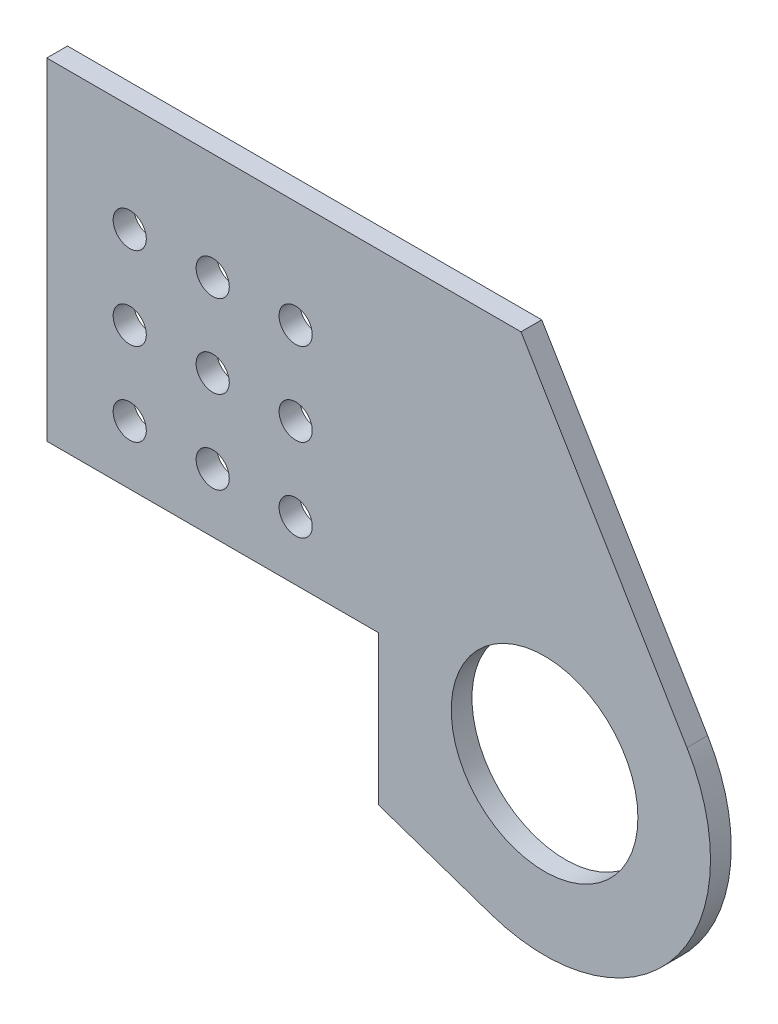
ISO-10303-21;
HEADER;
FILE_DESCRIPTION(('STEP AP214'),'2;1');
FILE_NAME('part.step','',(''),(''),'','','');
FILE_SCHEMA(('AUTOMOTIVE_DESIGN { 1 0 10303 214 1 1 1 1 }'));
ENDSEC;
DATA;
#1=APPLICATION_CONTEXT('core data for automotive mechanical design processes');
#2=APPLICATION_PROTOCOL_DEFINITION('international standard','automotive_design',2000,#1);
#3=PRODUCT_CONTEXT('',#1,'mechanical');
#4=PRODUCT('Part','Part','',(#3));
#5=PRODUCT_RELATED_PRODUCT_CATEGORY('part','',(#4));
#6=PRODUCT_DEFINITION_FORMATION('','',#4);
#7=PRODUCT_DEFINITION_CONTEXT('part definition',#1,'design');
#8=PRODUCT_DEFINITION('design','',#6,#7);
#9=PRODUCT_DEFINITION_SHAPE('','',#8);
#10=(LENGTH_UNIT() NAMED_UNIT(*) SI_UNIT(.MILLI.,.METRE.));
#11=(NAMED_UNIT(*) PLANE_ANGLE_UNIT() SI_UNIT($,.RADIAN.));
#12=(NAMED_UNIT(*) SI_UNIT($,.STERADIAN.) SOLID_ANGLE_UNIT());
#13=UNCERTAINTY_MEASURE_WITH_UNIT(LENGTH_MEASURE(1.E-05),#10,'distance_accuracy_value','');
#14=(GEOMETRIC_REPRESENTATION_CONTEXT(3) GLOBAL_UNCERTAINTY_ASSIGNED_CONTEXT((#13)) GLOBAL_UNIT_ASSIGNED_CONTEXT((#10,
#11,#12)) REPRESENTATION_CONTEXT('',''));
#15=CARTESIAN_POINT('',(0.,0.,0.));
#16=DIRECTION('',(0.,0.,1.));
#17=DIRECTION('',(1.,0.,0.));
#18=AXIS2_PLACEMENT_3D('',#15,#16,#17);
#19=CARTESIAN_POINT('',(76.2,-4.6676676490266,3.175));
#20=DIRECTION('',(0.,0.,-1.));
#21=DIRECTION('',(-1.,0.,0.));
#22=AXIS2_PLACEMENT_3D('',#19,#20,#21);
#23=CYLINDRICAL_SURFACE('',#22,25.4);
#24=CARTESIAN_POINT('',(76.2,-4.6676676490266,0.));
#25=DIRECTION('',(0.,0.,1.));
#26=DIRECTION('',(1.,0.,0.));
#27=AXIS2_PLACEMENT_3D('',#24,#25,#26);
#28=CIRCLE('',#27,25.4);
#29=CARTESIAN_POINT('',(97.9919431570772,8.38113357709056,0.));
#30=VERTEX_POINT('',#29);
#31=CARTESIAN_POINT('',(67.9854944904152,-28.7026816750887,0.));
#32=VERTEX_POINT('',#31);
#33=EDGE_CURVE('E147',#30,#32,#28,.F.);
#34=ORIENTED_EDGE('',*,*,#33,.F.);
#35=DIRECTION('',(0.,0.,-1.));
#36=VECTOR('',#35,1.);
#37=CARTESIAN_POINT('',(97.9919431570772,8.38113357709056,3.175));
#38=LINE('',#37,#36);
#39=CARTESIAN_POINT('',(97.9919431570772,8.38113357709056,3.175));
#40=VERTEX_POINT('',#39);
#41=EDGE_CURVE('E11',#40,#30,#38,.T.);
#42=ORIENTED_EDGE('',*,*,#41,.F.);
#43=CARTESIAN_POINT('',(76.2,-4.6676676490266,3.175));
#44=DIRECTION('',(0.,0.,1.));
#45=DIRECTION('',(1.,0.,0.));
#46=AXIS2_PLACEMENT_3D('',#43,#44,#45);
#47=CIRCLE('',#46,25.4);
#48=CARTESIAN_POINT('',(67.9854944904152,-28.7026816750887,3.175));
#49=VERTEX_POINT('',#48);
#50=EDGE_CURVE('E401',#40,#49,#47,.F.);
#51=ORIENTED_EDGE('',*,*,#50,.T.);
#52=DIRECTION('',(0.,0.,-1.));
#53=VECTOR('',#52,1.);
#54=CARTESIAN_POINT('',(67.9854944904152,-28.7026816750887,3.175));
#55=LINE('',#54,#53);
#56=EDGE_CURVE('E58',#49,#32,#55,.T.);
#57=ORIENTED_EDGE('',*,*,#56,.T.);
#58=EDGE_LOOP('',(#34,#42,#51,#57));
#59=FACE_BOUND('',#58,.T.);
#60=ADVANCED_FACE('F41',(#59),#23,.T.);
#61=CARTESIAN_POINT('',(75.823863099134,45.4025834522974,3.175));
#62=DIRECTION('',(0.857950517995165,0.513732331736896,0.));
#63=DIRECTION('',(-0.513732331736896,0.857950517995165,0.));
#64=AXIS2_PLACEMENT_3D('',#61,#62,#63);
#65=PLANE('',#64);
#66=DIRECTION('',(0.513732331736896,-0.857950517995165,0.));
#67=VECTOR('',#66,1.);
#68=CARTESIAN_POINT('',(75.823863099134,45.4025834522974,0.));
#69=LINE('',#68,#67);
#70=CARTESIAN_POINT('',(72.5919431570772,50.8,0.));
#71=VERTEX_POINT('',#70);
#72=EDGE_CURVE('E144',#71,#30,#69,.T.);
#73=ORIENTED_EDGE('',*,*,#72,.F.);
#74=DIRECTION('',(0.,0.,-1.));
#75=VECTOR('',#74,1.);
#76=CARTESIAN_POINT('',(72.5919431570772,50.8,3.175));
#77=LINE('',#76,#75);
#78=CARTESIAN_POINT('',(72.5919431570772,50.8,3.175));
#79=VERTEX_POINT('',#78);
#80=EDGE_CURVE('E50',#79,#71,#77,.T.);
#81=ORIENTED_EDGE('',*,*,#80,.F.);
#82=DIRECTION('',(0.513732331736896,-0.857950517995165,0.));
#83=VECTOR('',#82,1.);
#84=CARTESIAN_POINT('',(75.823863099134,45.4025834522974,3.175));
#85=LINE('',#84,#83);
#86=EDGE_CURVE('E398',#79,#40,#85,.T.);
#87=ORIENTED_EDGE('',*,*,#86,.T.);
#88=ORIENTED_EDGE('',*,*,#41,.T.);
#89=EDGE_LOOP('',(#73,#81,#87,#88));
#90=FACE_BOUND('',#89,.T.);
#91=ADVANCED_FACE('F145',(#90),#65,.T.);
#92=CARTESIAN_POINT('',(0.,50.8,3.175));
#93=DIRECTION('',(0.,1.,0.));
#94=DIRECTION('',(0.,0.,1.));
#95=AXIS2_PLACEMENT_3D('',#92,#93,#94);
#96=PLANE('',#95);
#97=DIRECTION('',(1.,0.,0.));
#98=VECTOR('',#97,1.);
#99=CARTESIAN_POINT('',(0.,50.8,0.));
#100=LINE('',#99,#98);
#101=CARTESIAN_POINT('',(0.,50.8,0.));
#102=VERTEX_POINT('',#101);
#103=EDGE_CURVE('E137',#102,#71,#100,.T.);
#104=ORIENTED_EDGE('',*,*,#103,.F.);
#105=DIRECTION('',(0.,0.,-1.));
#106=VECTOR('',#105,1.);
#107=CARTESIAN_POINT('',(0.,50.8,3.175));
#108=LINE('',#107,#106);
#109=CARTESIAN_POINT('',(0.,50.8,3.175));
#110=VERTEX_POINT('',#109);
#111=EDGE_CURVE('E126',#110,#102,#108,.T.);
#112=ORIENTED_EDGE('',*,*,#111,.F.);
#113=DIRECTION('',(1.,0.,0.));
#114=VECTOR('',#113,1.);
#115=CARTESIAN_POINT('',(0.,50.8,3.175));
#116=LINE('',#115,#114);
#117=EDGE_CURVE('E139',#110,#79,#116,.T.);
#118=ORIENTED_EDGE('',*,*,#117,.T.);
#119=ORIENTED_EDGE('',*,*,#80,.T.);
#120=EDGE_LOOP('',(#104,#112,#118,#119));
#121=FACE_BOUND('',#120,.T.);
#122=ADVANCED_FACE('F135',(#121),#96,.T.);
#123=CARTESIAN_POINT('',(0.,0.,3.175));
#124=DIRECTION('',(-1.,0.,0.));
#125=DIRECTION('',(0.,0.,1.));
#126=AXIS2_PLACEMENT_3D('',#123,#124,#125);
#127=PLANE('',#126);
#128=DIRECTION('',(0.,1.,0.));
#129=VECTOR('',#128,1.);
#130=CARTESIAN_POINT('',(0.,0.,0.));
#131=LINE('',#130,#129);
#132=CARTESIAN_POINT('',(0.,0.,0.));
#133=VERTEX_POINT('',#132);
#134=EDGE_CURVE('E151',#133,#102,#131,.T.);
#135=ORIENTED_EDGE('',*,*,#134,.F.);
#136=DIRECTION('',(0.,0.,-1.));
#137=VECTOR('',#136,1.);
#138=CARTESIAN_POINT('',(0.,0.,3.175));
#139=LINE('',#138,#137);
#140=CARTESIAN_POINT('',(0.,0.,3.175));
#141=VERTEX_POINT('',#140);
#142=EDGE_CURVE('E124',#141,#133,#139,.T.);
#143=ORIENTED_EDGE('',*,*,#142,.F.);
#144=DIRECTION('',(0.,1.,0.));
#145=VECTOR('',#144,1.);
#146=CARTESIAN_POINT('',(0.,0.,3.175));
#147=LINE('',#146,#145);
#148=EDGE_CURVE('E118',#141,#110,#147,.T.);
#149=ORIENTED_EDGE('',*,*,#148,.T.);
#150=ORIENTED_EDGE('',*,*,#111,.T.);
#151=EDGE_LOOP('',(#135,#143,#149,#150));
#152=FACE_BOUND('',#151,.T.);
#153=ADVANCED_FACE('F369',(#152),#127,.T.);
#154=CARTESIAN_POINT('',(0.,0.,3.175));
#155=DIRECTION('',(0.,1.,0.));
#156=DIRECTION('',(0.,0.,1.));
#157=AXIS2_PLACEMENT_3D('',#154,#155,#156);
#158=PLANE('',#157);
#159=DIRECTION('',(1.,0.,0.));
#160=VECTOR('',#159,1.);
#161=CARTESIAN_POINT('',(0.,0.,0.));
#162=LINE('',#161,#160);
#163=CARTESIAN_POINT('',(50.8,0.,0.));
#164=VERTEX_POINT('',#163);
#165=EDGE_CURVE('E123',#133,#164,#162,.T.);
#166=ORIENTED_EDGE('',*,*,#165,.T.);
#167=DIRECTION('',(0.,0.,-1.));
#168=VECTOR('',#167,1.);
#169=CARTESIAN_POINT('',(50.8,0.,3.175));
#170=LINE('',#169,#168);
#171=CARTESIAN_POINT('',(50.8,0.,3.175));
#172=VERTEX_POINT('',#171);
#173=EDGE_CURVE('E106',#172,#164,#170,.T.);
#174=ORIENTED_EDGE('',*,*,#173,.F.);
#175=DIRECTION('',(1.,0.,0.));
#176=VECTOR('',#175,1.);
#177=CARTESIAN_POINT('',(0.,0.,3.175));
#178=LINE('',#177,#176);
#179=EDGE_CURVE('E111',#141,#172,#178,.T.);
#180=ORIENTED_EDGE('',*,*,#179,.F.);
#181=ORIENTED_EDGE('',*,*,#142,.T.);
#182=EDGE_LOOP('',(#166,#174,#180,#181));
#183=FACE_BOUND('',#182,.T.);
#184=ADVANCED_FACE('F121',(#183),#158,.F.);
#185=CARTESIAN_POINT('',(50.8,0.,3.175));
#186=DIRECTION('',(1.,0.,0.));
#187=DIRECTION('',(0.,1.,0.));
#188=AXIS2_PLACEMENT_3D('',#185,#186,#187);
#189=PLANE('',#188);
#190=DIRECTION('',(0.,-1.,0.));
#191=VECTOR('',#190,1.);
#192=CARTESIAN_POINT('',(50.8,0.,0.));
#193=LINE('',#192,#191);
#194=CARTESIAN_POINT('',(50.8,-22.8291532043593,0.));
#195=VERTEX_POINT('',#194);
#196=EDGE_CURVE('E157',#164,#195,#193,.T.);
#197=ORIENTED_EDGE('',*,*,#196,.T.);
#198=DIRECTION('',(0.,0.,-1.));
#199=VECTOR('',#198,1.);
#200=CARTESIAN_POINT('',(50.8,-22.8291532043593,3.175));
#201=LINE('',#200,#199);
#202=CARTESIAN_POINT('',(50.8,-22.8291532043593,3.175));
#203=VERTEX_POINT('',#202);
#204=EDGE_CURVE('E81',#203,#195,#201,.T.);
#205=ORIENTED_EDGE('',*,*,#204,.F.);
#206=DIRECTION('',(0.,-1.,0.));
#207=VECTOR('',#206,1.);
#208=CARTESIAN_POINT('',(50.8,0.,3.175));
#209=LINE('',#208,#207);
#210=EDGE_CURVE('E102',#172,#203,#209,.T.);
#211=ORIENTED_EDGE('',*,*,#210,.F.);
#212=ORIENTED_EDGE('',*,*,#173,.T.);
#213=EDGE_LOOP('',(#197,#205,#211,#212));
#214=FACE_BOUND('',#213,.T.);
#215=ADVANCED_FACE('F104',(#214),#189,.F.);
#216=CARTESIAN_POINT('',(12.7,34.4279406596627,3.175));
#217=DIRECTION('',(0.,0.,-1.));
#218=DIRECTION('',(-1.,0.,0.));
#219=AXIS2_PLACEMENT_3D('',#216,#217,#218);
#220=CYLINDRICAL_SURFACE('',#219,2.54);
#221=CARTESIAN_POINT('',(12.7,34.4279406596627,3.175));
#222=DIRECTION('',(0.,0.,1.));
#223=DIRECTION('',(1.,0.,0.));
#224=AXIS2_PLACEMENT_3D('',#221,#222,#223);
#225=CIRCLE('',#224,2.54);
#226=CARTESIAN_POINT('',(15.24,34.4279406596627,3.175));
#227=VERTEX_POINT('',#226);
#228=EDGE_CURVE('E405',#227,#227,#225,.T.);
#229=ORIENTED_EDGE('',*,*,#228,.T.);
#230=EDGE_LOOP('',(#229));
#231=FACE_BOUND('',#230,.T.);
#232=CARTESIAN_POINT('',(12.7,34.4279406596627,0.));
#233=DIRECTION('',(0.,0.,1.));
#234=DIRECTION('',(1.,0.,0.));
#235=AXIS2_PLACEMENT_3D('',#232,#233,#234);
#236=CIRCLE('',#235,2.54);
#237=CARTESIAN_POINT('',(15.24,34.4279406596627,0.));
#238=VERTEX_POINT('',#237);
#239=EDGE_CURVE('E191',#238,#238,#236,.T.);
#240=ORIENTED_EDGE('',*,*,#239,.F.);
#241=EDGE_LOOP('',(#240));
#242=FACE_BOUND('',#241,.T.);
#243=ADVANCED_FACE('F214',(#231,#242),#220,.F.);
#244=CARTESIAN_POINT('',(25.4,34.4279406596627,3.175));
#245=DIRECTION('',(0.,0.,-1.));
#246=DIRECTION('',(-1.,0.,0.));
#247=AXIS2_PLACEMENT_3D('',#244,#245,#246);
#248=CYLINDRICAL_SURFACE('',#247,2.54);
#249=CARTESIAN_POINT('',(25.4,34.4279406596627,3.175));
#250=DIRECTION('',(0.,0.,1.));
#251=DIRECTION('',(1.,0.,0.));
#252=AXIS2_PLACEMENT_3D('',#249,#250,#251);
#253=CIRCLE('',#252,2.54);
#254=CARTESIAN_POINT('',(27.94,34.4279406596627,3.175));
#255=VERTEX_POINT('',#254);
#256=EDGE_CURVE('E408',#255,#255,#253,.T.);
#257=ORIENTED_EDGE('',*,*,#256,.T.);
#258=EDGE_LOOP('',(#257));
#259=FACE_BOUND('',#258,.T.);
#260=CARTESIAN_POINT('',(25.4,34.4279406596627,0.));
#261=DIRECTION('',(0.,0.,1.));
#262=DIRECTION('',(1.,0.,0.));
#263=AXIS2_PLACEMENT_3D('',#260,#261,#262);
#264=CIRCLE('',#263,2.54);
#265=CARTESIAN_POINT('',(27.94,34.4279406596627,0.));
#266=VERTEX_POINT('',#265);
#267=EDGE_CURVE('E188',#266,#266,#264,.T.);
#268=ORIENTED_EDGE('',*,*,#267,.F.);
#269=EDGE_LOOP('',(#268));
#270=FACE_BOUND('',#269,.T.);
#271=ADVANCED_FACE('F217',(#259,#270),#248,.F.);
#272=CARTESIAN_POINT('',(38.1,34.4279406596627,3.175));
#273=DIRECTION('',(0.,0.,-1.));
#274=DIRECTION('',(-1.,0.,0.));
#275=AXIS2_PLACEMENT_3D('',#272,#273,#274);
#276=CYLINDRICAL_SURFACE('',#275,2.54);
#277=CARTESIAN_POINT('',(38.1,34.4279406596627,3.175));
#278=DIRECTION('',(0.,0.,1.));
#279=DIRECTION('',(1.,0.,0.));
#280=AXIS2_PLACEMENT_3D('',#277,#278,#279);
#281=CIRCLE('',#280,2.54);
#282=CARTESIAN_POINT('',(40.64,34.4279406596627,3.175));
#283=VERTEX_POINT('',#282);
#284=EDGE_CURVE('E411',#283,#283,#281,.T.);
#285=ORIENTED_EDGE('',*,*,#284,.T.);
#286=EDGE_LOOP('',(#285));
#287=FACE_BOUND('',#286,.T.);
#288=CARTESIAN_POINT('',(38.1,34.4279406596627,0.));
#289=DIRECTION('',(0.,0.,1.));
#290=DIRECTION('',(1.,0.,0.));
#291=AXIS2_PLACEMENT_3D('',#288,#289,#290);
#292=CIRCLE('',#291,2.54);
#293=CARTESIAN_POINT('',(40.64,34.4279406596627,0.));
#294=VERTEX_POINT('',#293);
#295=EDGE_CURVE('E185',#294,#294,#292,.T.);
#296=ORIENTED_EDGE('',*,*,#295,.F.);
#297=EDGE_LOOP('',(#296));
#298=FACE_BOUND('',#297,.T.);
#299=ADVANCED_FACE('F221',(#287,#298),#276,.F.);
#300=CARTESIAN_POINT('',(25.4,21.7279406596627,3.175));
#301=DIRECTION('',(0.,0.,-1.));
#302=DIRECTION('',(-1.,0.,0.));
#303=AXIS2_PLACEMENT_3D('',#300,#301,#302);
#304=CYLINDRICAL_SURFACE('',#303,2.54);
#305=CARTESIAN_POINT('',(25.4,21.7279406596627,3.175));
#306=DIRECTION('',(0.,0.,1.));
#307=DIRECTION('',(1.,0.,0.));
#308=AXIS2_PLACEMENT_3D('',#305,#306,#307);
#309=CIRCLE('',#308,2.54);
#310=CARTESIAN_POINT('',(27.94,21.7279406596627,3.175));
#311=VERTEX_POINT('',#310);
#312=EDGE_CURVE('E414',#311,#311,#309,.T.);
#313=ORIENTED_EDGE('',*,*,#312,.T.);
#314=EDGE_LOOP('',(#313));
#315=FACE_BOUND('',#314,.T.);
#316=CARTESIAN_POINT('',(25.4,21.7279406596627,0.));
#317=DIRECTION('',(0.,0.,1.));
#318=DIRECTION('',(1.,0.,0.));
#319=AXIS2_PLACEMENT_3D('',#316,#317,#318);
#320=CIRCLE('',#319,2.54);
#321=CARTESIAN_POINT('',(27.94,21.7279406596627,0.));
#322=VERTEX_POINT('',#321);
#323=EDGE_CURVE('E182',#322,#322,#320,.T.);
#324=ORIENTED_EDGE('',*,*,#323,.F.);
#325=EDGE_LOOP('',(#324));
#326=FACE_BOUND('',#325,.T.);
#327=ADVANCED_FACE('F225',(#315,#326),#304,.F.);
#328=CARTESIAN_POINT('',(38.1,21.7279406596627,3.175));
#329=DIRECTION('',(0.,0.,-1.));
#330=DIRECTION('',(-1.,0.,0.));
#331=AXIS2_PLACEMENT_3D('',#328,#329,#330);
#332=CYLINDRICAL_SURFACE('',#331,2.54);
#333=CARTESIAN_POINT('',(38.1,21.7279406596627,3.175));
#334=DIRECTION('',(0.,0.,1.));
#335=DIRECTION('',(1.,0.,0.));
#336=AXIS2_PLACEMENT_3D('',#333,#334,#335);
#337=CIRCLE('',#336,2.54);
#338=CARTESIAN_POINT('',(40.64,21.7279406596627,3.175));
#339=VERTEX_POINT('',#338);
#340=EDGE_CURVE('E417',#339,#339,#337,.T.);
#341=ORIENTED_EDGE('',*,*,#340,.T.);
#342=EDGE_LOOP('',(#341));
#343=FACE_BOUND('',#342,.T.);
#344=CARTESIAN_POINT('',(38.1,21.7279406596627,0.));
#345=DIRECTION('',(0.,0.,1.));
#346=DIRECTION('',(1.,0.,0.));
#347=AXIS2_PLACEMENT_3D('',#344,#345,#346);
#348=CIRCLE('',#347,2.54);
#349=CARTESIAN_POINT('',(40.64,21.7279406596627,0.));
#350=VERTEX_POINT('',#349);
#351=EDGE_CURVE('E179',#350,#350,#348,.T.);
#352=ORIENTED_EDGE('',*,*,#351,.F.);
#353=EDGE_LOOP('',(#352));
#354=FACE_BOUND('',#353,.T.);
#355=ADVANCED_FACE('F229',(#343,#354),#332,.F.);
#356=CARTESIAN_POINT('',(25.4,9.02794065966268,3.175));
#357=DIRECTION('',(0.,0.,-1.));
#358=DIRECTION('',(-1.,0.,0.));
#359=AXIS2_PLACEMENT_3D('',#356,#357,#358);
#360=CYLINDRICAL_SURFACE('',#359,2.54);
#361=CARTESIAN_POINT('',(25.4,9.02794065966268,3.175));
#362=DIRECTION('',(0.,0.,1.));
#363=DIRECTION('',(1.,0.,0.));
#364=AXIS2_PLACEMENT_3D('',#361,#362,#363);
#365=CIRCLE('',#364,2.54);
#366=CARTESIAN_POINT('',(27.94,9.02794065966268,3.175));
#367=VERTEX_POINT('',#366);
#368=EDGE_CURVE('E420',#367,#367,#365,.T.);
#369=ORIENTED_EDGE('',*,*,#368,.T.);
#370=EDGE_LOOP('',(#369));
#371=FACE_BOUND('',#370,.T.);
#372=CARTESIAN_POINT('',(25.4,9.02794065966268,0.));
#373=DIRECTION('',(0.,0.,1.));
#374=DIRECTION('',(1.,0.,0.));
#375=AXIS2_PLACEMENT_3D('',#372,#373,#374);
#376=CIRCLE('',#375,2.54);
#377=CARTESIAN_POINT('',(27.94,9.02794065966268,0.));
#378=VERTEX_POINT('',#377);
#379=EDGE_CURVE('E176',#378,#378,#376,.T.);
#380=ORIENTED_EDGE('',*,*,#379,.F.);
#381=EDGE_LOOP('',(#380));
#382=FACE_BOUND('',#381,.T.);
#383=ADVANCED_FACE('F233',(#371,#382),#360,.F.);
#384=CARTESIAN_POINT('',(38.1,9.02794065966268,3.175));
#385=DIRECTION('',(0.,0.,-1.));
#386=DIRECTION('',(-1.,0.,0.));
#387=AXIS2_PLACEMENT_3D('',#384,#385,#386);
#388=CYLINDRICAL_SURFACE('',#387,2.54);
#389=CARTESIAN_POINT('',(38.1,9.02794065966268,3.175));
#390=DIRECTION('',(0.,0.,1.));
#391=DIRECTION('',(1.,0.,0.));
#392=AXIS2_PLACEMENT_3D('',#389,#390,#391);
#393=CIRCLE('',#392,2.54);
#394=CARTESIAN_POINT('',(40.64,9.02794065966268,3.175));
#395=VERTEX_POINT('',#394);
#396=EDGE_CURVE('E423',#395,#395,#393,.T.);
#397=ORIENTED_EDGE('',*,*,#396,.T.);
#398=EDGE_LOOP('',(#397));
#399=FACE_BOUND('',#398,.T.);
#400=CARTESIAN_POINT('',(38.1,9.02794065966268,0.));
#401=DIRECTION('',(0.,0.,1.));
#402=DIRECTION('',(1.,0.,0.));
#403=AXIS2_PLACEMENT_3D('',#400,#401,#402);
#404=CIRCLE('',#403,2.54);
#405=CARTESIAN_POINT('',(40.64,9.02794065966268,0.));
#406=VERTEX_POINT('',#405);
#407=EDGE_CURVE('E173',#406,#406,#404,.T.);
#408=ORIENTED_EDGE('',*,*,#407,.F.);
#409=EDGE_LOOP('',(#408));
#410=FACE_BOUND('',#409,.T.);
#411=ADVANCED_FACE('F237',(#399,#410),#388,.F.);
#412=CARTESIAN_POINT('',(12.7,21.7279406596627,3.175));
#413=DIRECTION('',(0.,0.,-1.));
#414=DIRECTION('',(-1.,0.,0.));
#415=AXIS2_PLACEMENT_3D('',#412,#413,#414);
#416=CYLINDRICAL_SURFACE('',#415,2.54);
#417=CARTESIAN_POINT('',(12.7,21.7279406596627,3.175));
#418=DIRECTION('',(0.,0.,1.));
#419=DIRECTION('',(1.,0.,0.));
#420=AXIS2_PLACEMENT_3D('',#417,#418,#419);
#421=CIRCLE('',#420,2.54);
#422=CARTESIAN_POINT('',(15.24,21.7279406596627,3.175));
#423=VERTEX_POINT('',#422);
#424=EDGE_CURVE('E426',#423,#423,#421,.T.);
#425=ORIENTED_EDGE('',*,*,#424,.T.);
#426=EDGE_LOOP('',(#425));
#427=FACE_BOUND('',#426,.T.);
#428=CARTESIAN_POINT('',(12.7,21.7279406596627,0.));
#429=DIRECTION('',(0.,0.,1.));
#430=DIRECTION('',(1.,0.,0.));
#431=AXIS2_PLACEMENT_3D('',#428,#429,#430);
#432=CIRCLE('',#431,2.54);
#433=CARTESIAN_POINT('',(15.24,21.7279406596627,0.));
#434=VERTEX_POINT('',#433);
#435=EDGE_CURVE('E170',#434,#434,#432,.T.);
#436=ORIENTED_EDGE('',*,*,#435,.F.);
#437=EDGE_LOOP('',(#436));
#438=FACE_BOUND('',#437,.T.);
#439=ADVANCED_FACE('F241',(#427,#438),#416,.F.);
#440=CARTESIAN_POINT('',(12.7,9.02794065966268,3.175));
#441=DIRECTION('',(0.,0.,-1.));
#442=DIRECTION('',(-1.,0.,0.));
#443=AXIS2_PLACEMENT_3D('',#440,#441,#442);
#444=CYLINDRICAL_SURFACE('',#443,2.54);
#445=CARTESIAN_POINT('',(12.7,9.02794065966268,3.175));
#446=DIRECTION('',(0.,0.,1.));
#447=DIRECTION('',(1.,0.,0.));
#448=AXIS2_PLACEMENT_3D('',#445,#446,#447);
#449=CIRCLE('',#448,2.54);
#450=CARTESIAN_POINT('',(15.24,9.02794065966268,3.175));
#451=VERTEX_POINT('',#450);
#452=EDGE_CURVE('E252',#451,#451,#449,.T.);
#453=ORIENTED_EDGE('',*,*,#452,.T.);
#454=EDGE_LOOP('',(#453));
#455=FACE_BOUND('',#454,.T.);
#456=CARTESIAN_POINT('',(12.7,9.02794065966268,0.));
#457=DIRECTION('',(0.,0.,1.));
#458=DIRECTION('',(1.,0.,0.));
#459=AXIS2_PLACEMENT_3D('',#456,#457,#458);
#460=CIRCLE('',#459,2.54);
#461=CARTESIAN_POINT('',(15.24,9.02794065966268,0.));
#462=VERTEX_POINT('',#461);
#463=EDGE_CURVE('E167',#462,#462,#460,.T.);
#464=ORIENTED_EDGE('',*,*,#463,.F.);
#465=EDGE_LOOP('',(#464));
#466=FACE_BOUND('',#465,.T.);
#467=ADVANCED_FACE('F202',(#455,#466),#444,.F.);
#468=CARTESIAN_POINT('',(76.2,-4.6676676490266,3.175));
#469=DIRECTION('',(0.,0.,-1.));
#470=DIRECTION('',(-1.,0.,0.));
#471=AXIS2_PLACEMENT_3D('',#468,#469,#470);
#472=CYLINDRICAL_SURFACE('',#471,14.287499999975);
#473=CARTESIAN_POINT('',(76.2,-4.6676676490266,3.175));
#474=DIRECTION('',(0.,0.,1.));
#475=DIRECTION('',(1.,0.,0.));
#476=AXIS2_PLACEMENT_3D('',#473,#474,#475);
#477=CIRCLE('',#476,14.287499999975);
#478=CARTESIAN_POINT('',(90.487499999975,-4.6676676490266,3.175));
#479=VERTEX_POINT('',#478);
#480=EDGE_CURVE('E161',#479,#479,#477,.T.);
#481=ORIENTED_EDGE('',*,*,#480,.T.);
#482=EDGE_LOOP('',(#481));
#483=FACE_BOUND('',#482,.T.);
#484=CARTESIAN_POINT('',(76.2,-4.6676676490266,0.));
#485=DIRECTION('',(0.,0.,1.));
#486=DIRECTION('',(1.,0.,0.));
#487=AXIS2_PLACEMENT_3D('',#484,#485,#486);
#488=CIRCLE('',#487,14.287499999975);
#489=CARTESIAN_POINT('',(90.487499999975,-4.6676676490266,0.));
#490=VERTEX_POINT('',#489);
#491=EDGE_CURVE('E164',#490,#490,#488,.T.);
#492=ORIENTED_EDGE('',*,*,#491,.F.);
#493=EDGE_LOOP('',(#492));
#494=FACE_BOUND('',#493,.T.);
#495=ADVANCED_FACE('F43',(#483,#494),#472,.F.);
#496=CARTESIAN_POINT('',(-1.67307890003513,-4.89530073138697,3.175));
#497=DIRECTION('',(-0.323405728723812,-0.946260394726853,0.));
#498=DIRECTION('',(0.946260394726853,-0.323405728723812,0.));
#499=AXIS2_PLACEMENT_3D('',#496,#497,#498);
#500=PLANE('',#499);
#501=DIRECTION('',(-0.946260394726853,0.323405728723812,0.));
#502=VECTOR('',#501,1.);
#503=CARTESIAN_POINT('',(-1.67307890003513,-4.89530073138697,0.));
#504=LINE('',#503,#502);
#505=EDGE_CURVE('E159',#32,#195,#504,.T.);
#506=ORIENTED_EDGE('',*,*,#505,.F.);
#507=ORIENTED_EDGE('',*,*,#56,.F.);
#508=DIRECTION('',(-0.946260394726853,0.323405728723812,0.));
#509=VECTOR('',#508,1.);
#510=CARTESIAN_POINT('',(-1.67307890003513,-4.89530073138697,3.175));
#511=LINE('',#510,#509);
#512=EDGE_CURVE('E110',#49,#203,#511,.T.);
#513=ORIENTED_EDGE('',*,*,#512,.T.);
#514=ORIENTED_EDGE('',*,*,#204,.T.);
#515=EDGE_LOOP('',(#506,#507,#513,#514));
#516=FACE_BOUND('',#515,.T.);
#517=ADVANCED_FACE('F193',(#516),#500,.T.);
#518=CARTESIAN_POINT('',(0.,0.,3.175));
#519=DIRECTION('',(0.,0.,1.));
#520=DIRECTION('',(1.,0.,0.));
#521=AXIS2_PLACEMENT_3D('',#518,#519,#520);
#522=PLANE('',#521);
#523=ORIENTED_EDGE('',*,*,#480,.F.);
#524=EDGE_LOOP('',(#523));
#525=FACE_BOUND('',#524,.T.);
#526=ORIENTED_EDGE('',*,*,#452,.F.);
#527=EDGE_LOOP('',(#526));
#528=FACE_BOUND('',#527,.T.);
#529=ORIENTED_EDGE('',*,*,#424,.F.);
#530=EDGE_LOOP('',(#529));
#531=FACE_BOUND('',#530,.T.);
#532=ORIENTED_EDGE('',*,*,#396,.F.);
#533=EDGE_LOOP('',(#532));
#534=FACE_BOUND('',#533,.T.);
#535=ORIENTED_EDGE('',*,*,#368,.F.);
#536=EDGE_LOOP('',(#535));
#537=FACE_BOUND('',#536,.T.);
#538=ORIENTED_EDGE('',*,*,#340,.F.);
#539=EDGE_LOOP('',(#538));
#540=FACE_BOUND('',#539,.T.);
#541=ORIENTED_EDGE('',*,*,#312,.F.);
#542=EDGE_LOOP('',(#541));
#543=FACE_BOUND('',#542,.T.);
#544=ORIENTED_EDGE('',*,*,#284,.F.);
#545=EDGE_LOOP('',(#544));
#546=FACE_BOUND('',#545,.T.);
#547=ORIENTED_EDGE('',*,*,#256,.F.);
#548=EDGE_LOOP('',(#547));
#549=FACE_BOUND('',#548,.T.);
#550=ORIENTED_EDGE('',*,*,#228,.F.);
#551=EDGE_LOOP('',(#550));
#552=FACE_BOUND('',#551,.T.);
#553=ORIENTED_EDGE('',*,*,#50,.F.);
#554=ORIENTED_EDGE('',*,*,#86,.F.);
#555=ORIENTED_EDGE('',*,*,#117,.F.);
#556=ORIENTED_EDGE('',*,*,#148,.F.);
#557=ORIENTED_EDGE('',*,*,#179,.T.);
#558=ORIENTED_EDGE('',*,*,#210,.T.);
#559=ORIENTED_EDGE('',*,*,#512,.F.);
#560=EDGE_LOOP('',(#553,#554,#555,#556,#557,#558,#559));
#561=FACE_BOUND('',#560,.T.);
#562=ADVANCED_FACE('F115',(#525,#528,#531,#534,#537,#540,#543,#546,#549,#552,#561),#522,.T.);
#563=CARTESIAN_POINT('',(0.,0.,0.));
#564=DIRECTION('',(0.,0.,1.));
#565=DIRECTION('',(1.,0.,0.));
#566=AXIS2_PLACEMENT_3D('',#563,#564,#565);
#567=PLANE('',#566);
#568=ORIENTED_EDGE('',*,*,#491,.T.);
#569=EDGE_LOOP('',(#568));
#570=FACE_BOUND('',#569,.T.);
#571=ORIENTED_EDGE('',*,*,#463,.T.);
#572=EDGE_LOOP('',(#571));
#573=FACE_BOUND('',#572,.T.);
#574=ORIENTED_EDGE('',*,*,#435,.T.);
#575=EDGE_LOOP('',(#574));
#576=FACE_BOUND('',#575,.T.);
#577=ORIENTED_EDGE('',*,*,#407,.T.);
#578=EDGE_LOOP('',(#577));
#579=FACE_BOUND('',#578,.T.);
#580=ORIENTED_EDGE('',*,*,#379,.T.);
#581=EDGE_LOOP('',(#580));
#582=FACE_BOUND('',#581,.T.);
#583=ORIENTED_EDGE('',*,*,#351,.T.);
#584=EDGE_LOOP('',(#583));
#585=FACE_BOUND('',#584,.T.);
#586=ORIENTED_EDGE('',*,*,#323,.T.);
#587=EDGE_LOOP('',(#586));
#588=FACE_BOUND('',#587,.T.);
#589=ORIENTED_EDGE('',*,*,#295,.T.);
#590=EDGE_LOOP('',(#589));
#591=FACE_BOUND('',#590,.T.);
#592=ORIENTED_EDGE('',*,*,#267,.T.);
#593=EDGE_LOOP('',(#592));
#594=FACE_BOUND('',#593,.T.);
#595=ORIENTED_EDGE('',*,*,#239,.T.);
#596=EDGE_LOOP('',(#595));
#597=FACE_BOUND('',#596,.T.);
#598=ORIENTED_EDGE('',*,*,#33,.T.);
#599=ORIENTED_EDGE('',*,*,#505,.T.);
#600=ORIENTED_EDGE('',*,*,#196,.F.);
#601=ORIENTED_EDGE('',*,*,#165,.F.);
#602=ORIENTED_EDGE('',*,*,#134,.T.);
#603=ORIENTED_EDGE('',*,*,#103,.T.);
#604=ORIENTED_EDGE('',*,*,#72,.T.);
#605=EDGE_LOOP('',(#598,#599,#600,#601,#602,#603,#604));
#606=FACE_BOUND('',#605,.T.);
#607=ADVANCED_FACE('F149',(#570,#573,#576,#579,#582,#585,#588,#591,#594,#597,#606),#567,.F.);
#608=CLOSED_SHELL('',(#60,#91,#122,#153,#184,#215,#243,#271,#299,#327,#355,#383,#411,#439,#467,
#495,#517,#562,#607));
#609=MANIFOLD_SOLID_BREP('B2',#608);
#610=ADVANCED_BREP_SHAPE_REPRESENTATION('',(#18,#609),#14);
#611=SHAPE_DEFINITION_REPRESENTATION(#9,#610);
ENDSEC;
END-ISO-10303-21;
